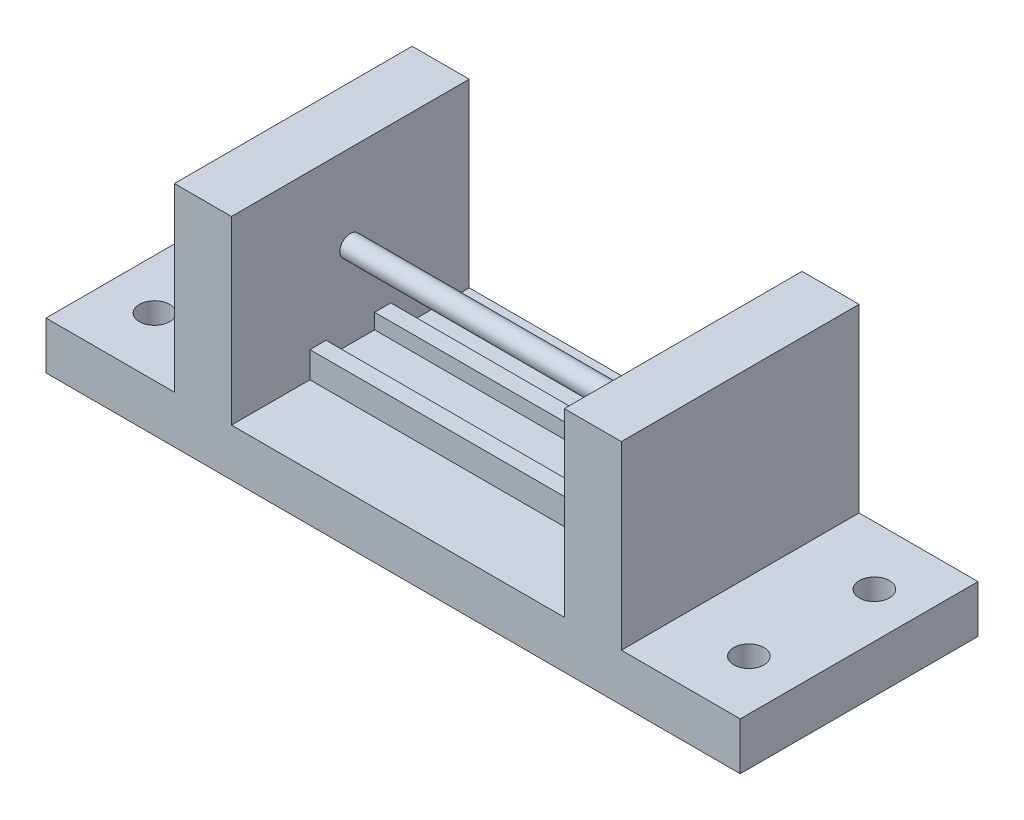
ISO-10303-21;
HEADER;
FILE_DESCRIPTION(('STEP AP214'),'2;1');
FILE_NAME('part.step','',(''),(''),'','','');
FILE_SCHEMA(('AUTOMOTIVE_DESIGN { 1 0 10303 214 1 1 1 1 }'));
ENDSEC;
DATA;
#1=APPLICATION_CONTEXT('core data for automotive mechanical design processes');
#2=APPLICATION_PROTOCOL_DEFINITION('international standard','automotive_design',2000,#1);
#3=PRODUCT_CONTEXT('',#1,'mechanical');
#4=PRODUCT('Part','Part','',(#3));
#5=PRODUCT_RELATED_PRODUCT_CATEGORY('part','',(#4));
#6=PRODUCT_DEFINITION_FORMATION('','',#4);
#7=PRODUCT_DEFINITION_CONTEXT('part definition',#1,'design');
#8=PRODUCT_DEFINITION('design','',#6,#7);
#9=PRODUCT_DEFINITION_SHAPE('','',#8);
#10=(LENGTH_UNIT() NAMED_UNIT(*) SI_UNIT(.MILLI.,.METRE.));
#11=(NAMED_UNIT(*) PLANE_ANGLE_UNIT() SI_UNIT($,.RADIAN.));
#12=(NAMED_UNIT(*) SI_UNIT($,.STERADIAN.) SOLID_ANGLE_UNIT());
#13=UNCERTAINTY_MEASURE_WITH_UNIT(LENGTH_MEASURE(1.E-05),#10,'distance_accuracy_value','');
#14=(GEOMETRIC_REPRESENTATION_CONTEXT(3) GLOBAL_UNCERTAINTY_ASSIGNED_CONTEXT((#13)) GLOBAL_UNIT_ASSIGNED_CONTEXT((#10,
#11,#12)) REPRESENTATION_CONTEXT('',''));
#15=CARTESIAN_POINT('',(0.,0.,0.));
#16=DIRECTION('',(0.,0.,1.));
#17=DIRECTION('',(1.,0.,0.));
#18=AXIS2_PLACEMENT_3D('',#15,#16,#17);
#19=CARTESIAN_POINT('',(32.7774603255584,30.2,25.));
#20=DIRECTION('',(1.,0.,0.));
#21=DIRECTION('',(0.,0.,-1.));
#22=AXIS2_PLACEMENT_3D('',#19,#20,#21);
#23=CYLINDRICAL_SURFACE('',#22,2.2);
#24=CARTESIAN_POINT('',(109.,30.2,25.));
#25=DIRECTION('',(1.,0.,0.));
#26=DIRECTION('',(0.,0.,-1.));
#27=AXIS2_PLACEMENT_3D('',#24,#25,#26);
#28=CIRCLE('',#27,2.2);
#29=CARTESIAN_POINT('',(109.,30.2,22.8));
#30=VERTEX_POINT('',#29);
#31=EDGE_CURVE('E20',#30,#30,#28,.F.);
#32=ORIENTED_EDGE('',*,*,#31,.T.);
#33=EDGE_LOOP('',(#32));
#34=FACE_BOUND('',#33,.T.);
#35=CARTESIAN_POINT('',(39.,30.2,25.));
#36=DIRECTION('',(1.,0.,0.));
#37=DIRECTION('',(0.,0.,-1.));
#38=AXIS2_PLACEMENT_3D('',#35,#36,#37);
#39=CIRCLE('',#38,2.2);
#40=CARTESIAN_POINT('',(39.,30.2,22.8));
#41=VERTEX_POINT('',#40);
#42=EDGE_CURVE('E229',#41,#41,#39,.T.);
#43=ORIENTED_EDGE('',*,*,#42,.T.);
#44=EDGE_LOOP('',(#43));
#45=FACE_BOUND('',#44,.T.);
#46=ADVANCED_FACE('F17',(#34,#45),#23,.T.);
#47=CARTESIAN_POINT('',(0.,15.5,0.));
#48=DIRECTION('',(0.,-1.,0.));
#49=DIRECTION('',(0.,0.,-1.));
#50=AXIS2_PLACEMENT_3D('',#47,#48,#49);
#51=PLANE('',#50);
#52=DIRECTION('',(-1.,0.,0.));
#53=VECTOR('',#52,1.);
#54=CARTESIAN_POINT('',(39.,15.5,19.9));
#55=LINE('',#54,#53);
#56=CARTESIAN_POINT('',(39.,15.5,19.9));
#57=VERTEX_POINT('',#56);
#58=CARTESIAN_POINT('',(109.,15.5,19.9));
#59=VERTEX_POINT('',#58);
#60=EDGE_CURVE('E200',#57,#59,#55,.F.);
#61=ORIENTED_EDGE('',*,*,#60,.T.);
#62=DIRECTION('',(0.,0.,-1.));
#63=VECTOR('',#62,1.);
#64=CARTESIAN_POINT('',(109.,15.5,0.));
#65=LINE('',#64,#63);
#66=CARTESIAN_POINT('',(109.,15.5,16.5));
#67=VERTEX_POINT('',#66);
#68=EDGE_CURVE('E250',#59,#67,#65,.T.);
#69=ORIENTED_EDGE('',*,*,#68,.T.);
#70=DIRECTION('',(1.,0.,0.));
#71=VECTOR('',#70,1.);
#72=CARTESIAN_POINT('',(39.,15.5,16.5));
#73=LINE('',#72,#71);
#74=CARTESIAN_POINT('',(39.,15.5,16.5));
#75=VERTEX_POINT('',#74);
#76=EDGE_CURVE('E167',#67,#75,#73,.F.);
#77=ORIENTED_EDGE('',*,*,#76,.T.);
#78=DIRECTION('',(0.,0.,1.));
#79=VECTOR('',#78,1.);
#80=CARTESIAN_POINT('',(39.,15.5,0.));
#81=LINE('',#80,#79);
#82=EDGE_CURVE('E231',#75,#57,#81,.T.);
#83=ORIENTED_EDGE('',*,*,#82,.T.);
#84=EDGE_LOOP('',(#61,#69,#77,#83));
#85=FACE_BOUND('',#84,.T.);
#86=ADVANCED_FACE('F286',(#85),#51,.F.);
#87=CARTESIAN_POINT('',(39.,12.3,19.9));
#88=DIRECTION('',(0.,0.,-1.));
#89=DIRECTION('',(-1.,0.,0.));
#90=AXIS2_PLACEMENT_3D('',#87,#88,#89);
#91=PLANE('',#90);
#92=DIRECTION('',(0.,1.,0.));
#93=VECTOR('',#92,1.);
#94=CARTESIAN_POINT('',(39.,48.,19.9));
#95=LINE('',#94,#93);
#96=CARTESIAN_POINT('',(39.,12.3,19.9));
#97=VERTEX_POINT('',#96);
#98=EDGE_CURVE('E236',#57,#97,#95,.F.);
#99=ORIENTED_EDGE('',*,*,#98,.T.);
#100=DIRECTION('',(1.,0.,0.));
#101=VECTOR('',#100,1.);
#102=CARTESIAN_POINT('',(0.,12.3,19.9));
#103=LINE('',#102,#101);
#104=CARTESIAN_POINT('',(109.,12.3,19.9));
#105=VERTEX_POINT('',#104);
#106=EDGE_CURVE('E198',#97,#105,#103,.T.);
#107=ORIENTED_EDGE('',*,*,#106,.T.);
#108=DIRECTION('',(0.,1.,0.));
#109=VECTOR('',#108,1.);
#110=CARTESIAN_POINT('',(109.,48.,19.9));
#111=LINE('',#110,#109);
#112=EDGE_CURVE('E253',#105,#59,#111,.T.);
#113=ORIENTED_EDGE('',*,*,#112,.T.);
#114=ORIENTED_EDGE('',*,*,#60,.F.);
#115=EDGE_LOOP('',(#99,#107,#113,#114));
#116=FACE_BOUND('',#115,.T.);
#117=ADVANCED_FACE('F282',(#116),#91,.F.);
#118=CARTESIAN_POINT('',(0.,12.3,0.));
#119=DIRECTION('',(0.,-1.,0.));
#120=DIRECTION('',(0.,0.,-1.));
#121=AXIS2_PLACEMENT_3D('',#118,#119,#120);
#122=PLANE('',#121);
#123=DIRECTION('',(0.,0.,1.));
#124=VECTOR('',#123,1.);
#125=CARTESIAN_POINT('',(39.,12.3,0.));
#126=LINE('',#125,#124);
#127=CARTESIAN_POINT('',(39.,12.3,30.1));
#128=VERTEX_POINT('',#127);
#129=EDGE_CURVE('E275',#97,#128,#126,.T.);
#130=ORIENTED_EDGE('',*,*,#129,.T.);
#131=DIRECTION('',(1.,0.,0.));
#132=VECTOR('',#131,1.);
#133=CARTESIAN_POINT('',(109.,12.3,30.0999999999999));
#134=LINE('',#133,#132);
#135=CARTESIAN_POINT('',(109.,12.3,30.0999999999999));
#136=VERTEX_POINT('',#135);
#137=EDGE_CURVE('E196',#128,#136,#134,.T.);
#138=ORIENTED_EDGE('',*,*,#137,.T.);
#139=DIRECTION('',(0.,0.,-1.));
#140=VECTOR('',#139,1.);
#141=CARTESIAN_POINT('',(109.,12.3,0.));
#142=LINE('',#141,#140);
#143=EDGE_CURVE('E256',#136,#105,#142,.T.);
#144=ORIENTED_EDGE('',*,*,#143,.T.);
#145=ORIENTED_EDGE('',*,*,#106,.F.);
#146=EDGE_LOOP('',(#130,#138,#144,#145));
#147=FACE_BOUND('',#146,.T.);
#148=ADVANCED_FACE('F472',(#147),#122,.F.);
#149=CARTESIAN_POINT('',(109.,12.3,30.0999999999999));
#150=DIRECTION('',(0.,0.,1.));
#151=DIRECTION('',(1.,0.,0.));
#152=AXIS2_PLACEMENT_3D('',#149,#150,#151);
#153=PLANE('',#152);
#154=DIRECTION('',(0.,1.,0.));
#155=VECTOR('',#154,1.);
#156=CARTESIAN_POINT('',(109.,48.,30.0999999999999));
#157=LINE('',#156,#155);
#158=CARTESIAN_POINT('',(109.,15.5,30.1));
#159=VERTEX_POINT('',#158);
#160=EDGE_CURVE('E259',#159,#136,#157,.F.);
#161=ORIENTED_EDGE('',*,*,#160,.T.);
#162=ORIENTED_EDGE('',*,*,#137,.F.);
#163=DIRECTION('',(0.,1.,0.));
#164=VECTOR('',#163,1.);
#165=CARTESIAN_POINT('',(39.,48.,30.1));
#166=LINE('',#165,#164);
#167=CARTESIAN_POINT('',(39.,15.5,30.1));
#168=VERTEX_POINT('',#167);
#169=EDGE_CURVE('E271',#128,#168,#166,.T.);
#170=ORIENTED_EDGE('',*,*,#169,.T.);
#171=DIRECTION('',(1.,0.,0.));
#172=VECTOR('',#171,1.);
#173=CARTESIAN_POINT('',(0.,15.5,30.1));
#174=LINE('',#173,#172);
#175=EDGE_CURVE('E194',#168,#159,#174,.T.);
#176=ORIENTED_EDGE('',*,*,#175,.T.);
#177=EDGE_LOOP('',(#161,#162,#170,#176));
#178=FACE_BOUND('',#177,.T.);
#179=ADVANCED_FACE('F274',(#178),#153,.F.);
#180=CARTESIAN_POINT('',(0.,15.5,0.));
#181=DIRECTION('',(0.,-1.,0.));
#182=DIRECTION('',(0.,0.,-1.));
#183=AXIS2_PLACEMENT_3D('',#180,#181,#182);
#184=PLANE('',#183);
#185=ORIENTED_EDGE('',*,*,#175,.F.);
#186=DIRECTION('',(0.,0.,1.));
#187=VECTOR('',#186,1.);
#188=CARTESIAN_POINT('',(39.,15.5,0.));
#189=LINE('',#188,#187);
#190=CARTESIAN_POINT('',(39.,15.5,33.5));
#191=VERTEX_POINT('',#190);
#192=EDGE_CURVE('E263',#168,#191,#189,.T.);
#193=ORIENTED_EDGE('',*,*,#192,.T.);
#194=DIRECTION('',(-1.,0.,0.));
#195=VECTOR('',#194,1.);
#196=CARTESIAN_POINT('',(109.,15.5,33.5));
#197=LINE('',#196,#195);
#198=CARTESIAN_POINT('',(109.,15.5,33.5));
#199=VERTEX_POINT('',#198);
#200=EDGE_CURVE('E151',#191,#199,#197,.F.);
#201=ORIENTED_EDGE('',*,*,#200,.T.);
#202=DIRECTION('',(0.,0.,-1.));
#203=VECTOR('',#202,1.);
#204=CARTESIAN_POINT('',(109.,15.5,0.));
#205=LINE('',#204,#203);
#206=EDGE_CURVE('E177',#199,#159,#205,.T.);
#207=ORIENTED_EDGE('',*,*,#206,.T.);
#208=EDGE_LOOP('',(#185,#193,#201,#207));
#209=FACE_BOUND('',#208,.T.);
#210=ADVANCED_FACE('F261',(#209),#184,.F.);
#211=CARTESIAN_POINT('',(109.,15.5,33.5));
#212=DIRECTION('',(0.,0.,-1.));
#213=DIRECTION('',(-1.,0.,0.));
#214=AXIS2_PLACEMENT_3D('',#211,#212,#213);
#215=PLANE('',#214);
#216=DIRECTION('',(0.,1.,0.));
#217=VECTOR('',#216,1.);
#218=CARTESIAN_POINT('',(109.,48.,33.5));
#219=LINE('',#218,#217);
#220=CARTESIAN_POINT('',(109.,10.,33.5));
#221=VERTEX_POINT('',#220);
#222=EDGE_CURVE('E160',#221,#199,#219,.T.);
#223=ORIENTED_EDGE('',*,*,#222,.T.);
#224=ORIENTED_EDGE('',*,*,#200,.F.);
#225=DIRECTION('',(0.,1.,0.));
#226=VECTOR('',#225,1.);
#227=CARTESIAN_POINT('',(39.,48.,33.5));
#228=LINE('',#227,#226);
#229=CARTESIAN_POINT('',(39.,10.,33.5));
#230=VERTEX_POINT('',#229);
#231=EDGE_CURVE('E162',#191,#230,#228,.F.);
#232=ORIENTED_EDGE('',*,*,#231,.T.);
#233=DIRECTION('',(1.,0.,0.));
#234=VECTOR('',#233,1.);
#235=CARTESIAN_POINT('',(0.,10.,33.5));
#236=LINE('',#235,#234);
#237=EDGE_CURVE('E157',#221,#230,#236,.F.);
#238=ORIENTED_EDGE('',*,*,#237,.F.);
#239=EDGE_LOOP('',(#223,#224,#232,#238));
#240=FACE_BOUND('',#239,.T.);
#241=ADVANCED_FACE('F159',(#240),#215,.F.);
#242=CARTESIAN_POINT('',(39.,15.5,16.5));
#243=DIRECTION('',(0.,0.,1.));
#244=DIRECTION('',(1.,0.,0.));
#245=AXIS2_PLACEMENT_3D('',#242,#243,#244);
#246=PLANE('',#245);
#247=DIRECTION('',(0.,1.,0.));
#248=VECTOR('',#247,1.);
#249=CARTESIAN_POINT('',(39.,48.,16.5));
#250=LINE('',#249,#248);
#251=CARTESIAN_POINT('',(39.,10.,16.5));
#252=VERTEX_POINT('',#251);
#253=EDGE_CURVE('E290',#252,#75,#250,.T.);
#254=ORIENTED_EDGE('',*,*,#253,.T.);
#255=ORIENTED_EDGE('',*,*,#76,.F.);
#256=DIRECTION('',(0.,1.,0.));
#257=VECTOR('',#256,1.);
#258=CARTESIAN_POINT('',(109.,48.,16.5));
#259=LINE('',#258,#257);
#260=CARTESIAN_POINT('',(109.,10.,16.5));
#261=VERTEX_POINT('',#260);
#262=EDGE_CURVE('E244',#67,#261,#259,.F.);
#263=ORIENTED_EDGE('',*,*,#262,.T.);
#264=DIRECTION('',(1.,0.,0.));
#265=VECTOR('',#264,1.);
#266=CARTESIAN_POINT('',(0.,10.,16.5));
#267=LINE('',#266,#265);
#268=EDGE_CURVE('E238',#252,#261,#267,.T.);
#269=ORIENTED_EDGE('',*,*,#268,.F.);
#270=EDGE_LOOP('',(#254,#255,#263,#269));
#271=FACE_BOUND('',#270,.T.);
#272=ADVANCED_FACE('F291',(#271),#246,.F.);
#273=CARTESIAN_POINT('',(0.,10.,0.));
#274=DIRECTION('',(0.,1.,0.));
#275=DIRECTION('',(0.,0.,1.));
#276=AXIS2_PLACEMENT_3D('',#273,#274,#275);
#277=PLANE('',#276);
#278=DIRECTION('',(0.,0.,1.));
#279=VECTOR('',#278,1.);
#280=CARTESIAN_POINT('',(39.,10.,0.));
#281=LINE('',#280,#279);
#282=CARTESIAN_POINT('',(39.,10.,50.));
#283=VERTEX_POINT('',#282);
#284=EDGE_CURVE('E298',#230,#283,#281,.T.);
#285=ORIENTED_EDGE('',*,*,#284,.T.);
#286=DIRECTION('',(-1.,0.,0.));
#287=VECTOR('',#286,1.);
#288=CARTESIAN_POINT('',(0.,10.,50.));
#289=LINE('',#288,#287);
#290=CARTESIAN_POINT('',(109.,10.,50.));
#291=VERTEX_POINT('',#290);
#292=EDGE_CURVE('E182',#283,#291,#289,.F.);
#293=ORIENTED_EDGE('',*,*,#292,.T.);
#294=DIRECTION('',(0.,0.,-1.));
#295=VECTOR('',#294,1.);
#296=CARTESIAN_POINT('',(109.,10.,0.));
#297=LINE('',#296,#295);
#298=EDGE_CURVE('E174',#291,#221,#297,.T.);
#299=ORIENTED_EDGE('',*,*,#298,.T.);
#300=ORIENTED_EDGE('',*,*,#237,.T.);
#301=EDGE_LOOP('',(#285,#293,#299,#300));
#302=FACE_BOUND('',#301,.T.);
#303=ADVANCED_FACE('F180',(#302),#277,.T.);
#304=CARTESIAN_POINT('',(0.,10.,0.));
#305=DIRECTION('',(0.,1.,0.));
#306=DIRECTION('',(0.,0.,1.));
#307=AXIS2_PLACEMENT_3D('',#304,#305,#306);
#308=PLANE('',#307);
#309=CARTESIAN_POINT('',(136.5,10.,12.3));
#310=DIRECTION('',(0.,1.,0.));
#311=DIRECTION('',(0.,0.,1.));
#312=AXIS2_PLACEMENT_3D('',#309,#310,#311);
#313=CIRCLE('',#312,3.175);
#314=CARTESIAN_POINT('',(136.5,10.,15.475));
#315=VERTEX_POINT('',#314);
#316=EDGE_CURVE('E226',#315,#315,#313,.F.);
#317=ORIENTED_EDGE('',*,*,#316,.T.);
#318=EDGE_LOOP('',(#317));
#319=FACE_BOUND('',#318,.T.);
#320=CARTESIAN_POINT('',(135.5,10.,37.6803073267445));
#321=DIRECTION('',(0.,1.,0.));
#322=DIRECTION('',(0.,0.,1.));
#323=AXIS2_PLACEMENT_3D('',#320,#321,#322);
#324=CIRCLE('',#323,3.175);
#325=CARTESIAN_POINT('',(135.5,10.,40.8553073267445));
#326=VERTEX_POINT('',#325);
#327=EDGE_CURVE('E223',#326,#326,#324,.F.);
#328=ORIENTED_EDGE('',*,*,#327,.T.);
#329=EDGE_LOOP('',(#328));
#330=FACE_BOUND('',#329,.T.);
#331=DIRECTION('',(0.,0.,1.));
#332=VECTOR('',#331,1.);
#333=CARTESIAN_POINT('',(146.,10.,0.));
#334=LINE('',#333,#332);
#335=CARTESIAN_POINT('',(146.,10.,50.));
#336=VERTEX_POINT('',#335);
#337=CARTESIAN_POINT('',(146.,10.,0.));
#338=VERTEX_POINT('',#337);
#339=EDGE_CURVE('E370',#336,#338,#334,.F.);
#340=ORIENTED_EDGE('',*,*,#339,.T.);
#341=DIRECTION('',(1.,0.,0.));
#342=VECTOR('',#341,1.);
#343=CARTESIAN_POINT('',(0.,10.,0.));
#344=LINE('',#343,#342);
#345=CARTESIAN_POINT('',(121.,10.,0.));
#346=VERTEX_POINT('',#345);
#347=EDGE_CURVE('E364',#338,#346,#344,.F.);
#348=ORIENTED_EDGE('',*,*,#347,.T.);
#349=DIRECTION('',(0.,0.,1.));
#350=VECTOR('',#349,1.);
#351=CARTESIAN_POINT('',(121.,10.,0.));
#352=LINE('',#351,#350);
#353=CARTESIAN_POINT('',(121.,10.,50.));
#354=VERTEX_POINT('',#353);
#355=EDGE_CURVE('E166',#346,#354,#352,.T.);
#356=ORIENTED_EDGE('',*,*,#355,.T.);
#357=DIRECTION('',(-1.,0.,0.));
#358=VECTOR('',#357,1.);
#359=CARTESIAN_POINT('',(0.,10.,50.));
#360=LINE('',#359,#358);
#361=EDGE_CURVE('E374',#354,#336,#360,.F.);
#362=ORIENTED_EDGE('',*,*,#361,.T.);
#363=EDGE_LOOP('',(#340,#348,#356,#362));
#364=FACE_BOUND('',#363,.T.);
#365=ADVANCED_FACE('F394',(#319,#330,#364),#308,.T.);
#366=CARTESIAN_POINT('',(121.,48.,0.));
#367=DIRECTION('',(-1.,0.,0.));
#368=DIRECTION('',(0.,0.,1.));
#369=AXIS2_PLACEMENT_3D('',#366,#367,#368);
#370=PLANE('',#369);
#371=DIRECTION('',(0.,1.,0.));
#372=VECTOR('',#371,1.);
#373=CARTESIAN_POINT('',(121.,10.,0.));
#374=LINE('',#373,#372);
#375=CARTESIAN_POINT('',(121.,48.,0.));
#376=VERTEX_POINT('',#375);
#377=EDGE_CURVE('E361',#346,#376,#374,.T.);
#378=ORIENTED_EDGE('',*,*,#377,.T.);
#379=DIRECTION('',(0.,0.,-1.));
#380=VECTOR('',#379,1.);
#381=CARTESIAN_POINT('',(121.,48.,0.));
#382=LINE('',#381,#380);
#383=CARTESIAN_POINT('',(121.,48.,50.));
#384=VERTEX_POINT('',#383);
#385=EDGE_CURVE('E188',#376,#384,#382,.F.);
#386=ORIENTED_EDGE('',*,*,#385,.T.);
#387=DIRECTION('',(0.,1.,0.));
#388=VECTOR('',#387,1.);
#389=CARTESIAN_POINT('',(121.,10.,50.));
#390=LINE('',#389,#388);
#391=EDGE_CURVE('E376',#384,#354,#390,.F.);
#392=ORIENTED_EDGE('',*,*,#391,.T.);
#393=ORIENTED_EDGE('',*,*,#355,.F.);
#394=EDGE_LOOP('',(#378,#386,#392,#393));
#395=FACE_BOUND('',#394,.T.);
#396=ADVANCED_FACE('F389',(#395),#370,.F.);
#397=CARTESIAN_POINT('',(0.,48.,0.));
#398=DIRECTION('',(0.,-1.,0.));
#399=DIRECTION('',(0.,0.,-1.));
#400=AXIS2_PLACEMENT_3D('',#397,#398,#399);
#401=PLANE('',#400);
#402=DIRECTION('',(1.,0.,0.));
#403=VECTOR('',#402,1.);
#404=CARTESIAN_POINT('',(0.,48.,0.));
#405=LINE('',#404,#403);
#406=CARTESIAN_POINT('',(109.,48.,0.));
#407=VERTEX_POINT('',#406);
#408=EDGE_CURVE('E358',#376,#407,#405,.F.);
#409=ORIENTED_EDGE('',*,*,#408,.T.);
#410=DIRECTION('',(0.,0.,-1.));
#411=VECTOR('',#410,1.);
#412=CARTESIAN_POINT('',(109.,48.,0.));
#413=LINE('',#412,#411);
#414=CARTESIAN_POINT('',(109.,48.,50.));
#415=VERTEX_POINT('',#414);
#416=EDGE_CURVE('E183',#407,#415,#413,.F.);
#417=ORIENTED_EDGE('',*,*,#416,.T.);
#418=DIRECTION('',(-1.,0.,0.));
#419=VECTOR('',#418,1.);
#420=CARTESIAN_POINT('',(0.,48.,50.));
#421=LINE('',#420,#419);
#422=EDGE_CURVE('E379',#415,#384,#421,.F.);
#423=ORIENTED_EDGE('',*,*,#422,.T.);
#424=ORIENTED_EDGE('',*,*,#385,.F.);
#425=EDGE_LOOP('',(#409,#417,#423,#424));
#426=FACE_BOUND('',#425,.T.);
#427=ADVANCED_FACE('F386',(#426),#401,.F.);
#428=CARTESIAN_POINT('',(109.,48.,0.));
#429=DIRECTION('',(1.,0.,0.));
#430=DIRECTION('',(0.,0.,-1.));
#431=AXIS2_PLACEMENT_3D('',#428,#429,#430);
#432=PLANE('',#431);
#433=ORIENTED_EDGE('',*,*,#68,.F.);
#434=ORIENTED_EDGE('',*,*,#112,.F.);
#435=ORIENTED_EDGE('',*,*,#143,.F.);
#436=ORIENTED_EDGE('',*,*,#160,.F.);
#437=ORIENTED_EDGE('',*,*,#206,.F.);
#438=ORIENTED_EDGE('',*,*,#222,.F.);
#439=ORIENTED_EDGE('',*,*,#298,.F.);
#440=DIRECTION('',(0.,1.,0.));
#441=VECTOR('',#440,1.);
#442=CARTESIAN_POINT('',(109.,10.,50.));
#443=LINE('',#442,#441);
#444=EDGE_CURVE('E311',#291,#415,#443,.T.);
#445=ORIENTED_EDGE('',*,*,#444,.T.);
#446=ORIENTED_EDGE('',*,*,#416,.F.);
#447=DIRECTION('',(0.,1.,0.));
#448=VECTOR('',#447,1.);
#449=CARTESIAN_POINT('',(109.,10.,0.));
#450=LINE('',#449,#448);
#451=CARTESIAN_POINT('',(109.,10.,0.));
#452=VERTEX_POINT('',#451);
#453=EDGE_CURVE('E355',#407,#452,#450,.F.);
#454=ORIENTED_EDGE('',*,*,#453,.T.);
#455=DIRECTION('',(0.,0.,1.));
#456=VECTOR('',#455,1.);
#457=CARTESIAN_POINT('',(109.,10.,0.));
#458=LINE('',#457,#456);
#459=EDGE_CURVE('E232',#261,#452,#458,.F.);
#460=ORIENTED_EDGE('',*,*,#459,.F.);
#461=ORIENTED_EDGE('',*,*,#262,.F.);
#462=EDGE_LOOP('',(#433,#434,#435,#436,#437,#438,#439,#445,#446,#454,#460,#461));
#463=FACE_BOUND('',#462,.T.);
#464=ORIENTED_EDGE('',*,*,#31,.F.);
#465=EDGE_LOOP('',(#464));
#466=FACE_BOUND('',#465,.T.);
#467=ADVANCED_FACE('F171',(#463,#466),#432,.F.);
#468=CARTESIAN_POINT('',(0.,10.,0.));
#469=DIRECTION('',(0.,1.,0.));
#470=DIRECTION('',(0.,0.,1.));
#471=AXIS2_PLACEMENT_3D('',#468,#469,#470);
#472=PLANE('',#471);
#473=ORIENTED_EDGE('',*,*,#459,.T.);
#474=DIRECTION('',(1.,0.,0.));
#475=VECTOR('',#474,1.);
#476=CARTESIAN_POINT('',(0.,10.,0.));
#477=LINE('',#476,#475);
#478=CARTESIAN_POINT('',(39.,10.,0.));
#479=VERTEX_POINT('',#478);
#480=EDGE_CURVE('E353',#452,#479,#477,.F.);
#481=ORIENTED_EDGE('',*,*,#480,.T.);
#482=DIRECTION('',(0.,0.,1.));
#483=VECTOR('',#482,1.);
#484=CARTESIAN_POINT('',(39.,10.,0.));
#485=LINE('',#484,#483);
#486=EDGE_CURVE('E294',#479,#252,#485,.T.);
#487=ORIENTED_EDGE('',*,*,#486,.T.);
#488=ORIENTED_EDGE('',*,*,#268,.T.);
#489=EDGE_LOOP('',(#473,#481,#487,#488));
#490=FACE_BOUND('',#489,.T.);
#491=ADVANCED_FACE('F450',(#490),#472,.T.);
#492=CARTESIAN_POINT('',(39.,48.,0.));
#493=DIRECTION('',(-1.,0.,0.));
#494=DIRECTION('',(0.,0.,1.));
#495=AXIS2_PLACEMENT_3D('',#492,#493,#494);
#496=PLANE('',#495);
#497=ORIENTED_EDGE('',*,*,#486,.F.);
#498=DIRECTION('',(0.,1.,0.));
#499=VECTOR('',#498,1.);
#500=CARTESIAN_POINT('',(39.,10.,0.));
#501=LINE('',#500,#499);
#502=CARTESIAN_POINT('',(39.,48.,0.));
#503=VERTEX_POINT('',#502);
#504=EDGE_CURVE('E351',#479,#503,#501,.T.);
#505=ORIENTED_EDGE('',*,*,#504,.T.);
#506=DIRECTION('',(0.,0.,1.));
#507=VECTOR('',#506,1.);
#508=CARTESIAN_POINT('',(39.,48.,0.));
#509=LINE('',#508,#507);
#510=CARTESIAN_POINT('',(39.,48.,50.));
#511=VERTEX_POINT('',#510);
#512=EDGE_CURVE('E293',#511,#503,#509,.F.);
#513=ORIENTED_EDGE('',*,*,#512,.F.);
#514=DIRECTION('',(0.,1.,0.));
#515=VECTOR('',#514,1.);
#516=CARTESIAN_POINT('',(39.,10.,50.));
#517=LINE('',#516,#515);
#518=EDGE_CURVE('E308',#511,#283,#517,.F.);
#519=ORIENTED_EDGE('',*,*,#518,.T.);
#520=ORIENTED_EDGE('',*,*,#284,.F.);
#521=ORIENTED_EDGE('',*,*,#231,.F.);
#522=ORIENTED_EDGE('',*,*,#192,.F.);
#523=ORIENTED_EDGE('',*,*,#169,.F.);
#524=ORIENTED_EDGE('',*,*,#129,.F.);
#525=ORIENTED_EDGE('',*,*,#98,.F.);
#526=ORIENTED_EDGE('',*,*,#82,.F.);
#527=ORIENTED_EDGE('',*,*,#253,.F.);
#528=EDGE_LOOP('',(#497,#505,#513,#519,#520,#521,#522,#523,#524,#525,#526,#527));
#529=FACE_BOUND('',#528,.T.);
#530=ORIENTED_EDGE('',*,*,#42,.F.);
#531=EDGE_LOOP('',(#530));
#532=FACE_BOUND('',#531,.T.);
#533=ADVANCED_FACE('F268',(#529,#532),#496,.F.);
#534=CARTESIAN_POINT('',(0.,48.,0.));
#535=DIRECTION('',(0.,1.,0.));
#536=DIRECTION('',(0.,0.,1.));
#537=AXIS2_PLACEMENT_3D('',#534,#535,#536);
#538=PLANE('',#537);
#539=ORIENTED_EDGE('',*,*,#512,.T.);
#540=DIRECTION('',(1.,0.,0.));
#541=VECTOR('',#540,1.);
#542=CARTESIAN_POINT('',(0.,48.,0.));
#543=LINE('',#542,#541);
#544=CARTESIAN_POINT('',(27.,48.,0.));
#545=VERTEX_POINT('',#544);
#546=EDGE_CURVE('E328',#503,#545,#543,.F.);
#547=ORIENTED_EDGE('',*,*,#546,.T.);
#548=DIRECTION('',(0.,0.,-1.));
#549=VECTOR('',#548,1.);
#550=CARTESIAN_POINT('',(27.,48.,0.));
#551=LINE('',#550,#549);
#552=CARTESIAN_POINT('',(27.,48.,50.));
#553=VERTEX_POINT('',#552);
#554=EDGE_CURVE('E296',#545,#553,#551,.F.);
#555=ORIENTED_EDGE('',*,*,#554,.T.);
#556=DIRECTION('',(-1.,0.,0.));
#557=VECTOR('',#556,1.);
#558=CARTESIAN_POINT('',(0.,48.,50.));
#559=LINE('',#558,#557);
#560=EDGE_CURVE('E314',#553,#511,#559,.F.);
#561=ORIENTED_EDGE('',*,*,#560,.T.);
#562=EDGE_LOOP('',(#539,#547,#555,#561));
#563=FACE_BOUND('',#562,.T.);
#564=ADVANCED_FACE('F326',(#563),#538,.T.);
#565=CARTESIAN_POINT('',(27.,48.,0.));
#566=DIRECTION('',(1.,0.,0.));
#567=DIRECTION('',(0.,0.,-1.));
#568=AXIS2_PLACEMENT_3D('',#565,#566,#567);
#569=PLANE('',#568);
#570=DIRECTION('',(0.,1.,0.));
#571=VECTOR('',#570,1.);
#572=CARTESIAN_POINT('',(27.,10.,50.));
#573=LINE('',#572,#571);
#574=CARTESIAN_POINT('',(27.,10.,50.));
#575=VERTEX_POINT('',#574);
#576=EDGE_CURVE('E316',#575,#553,#573,.T.);
#577=ORIENTED_EDGE('',*,*,#576,.T.);
#578=ORIENTED_EDGE('',*,*,#554,.F.);
#579=DIRECTION('',(0.,1.,0.));
#580=VECTOR('',#579,1.);
#581=CARTESIAN_POINT('',(27.,10.,0.));
#582=LINE('',#581,#580);
#583=CARTESIAN_POINT('',(27.,10.,0.));
#584=VERTEX_POINT('',#583);
#585=EDGE_CURVE('E334',#545,#584,#582,.F.);
#586=ORIENTED_EDGE('',*,*,#585,.T.);
#587=DIRECTION('',(0.,0.,1.));
#588=VECTOR('',#587,1.);
#589=CARTESIAN_POINT('',(27.,10.,0.));
#590=LINE('',#589,#588);
#591=EDGE_CURVE('E228',#575,#584,#590,.F.);
#592=ORIENTED_EDGE('',*,*,#591,.F.);
#593=EDGE_LOOP('',(#577,#578,#586,#592));
#594=FACE_BOUND('',#593,.T.);
#595=ADVANCED_FACE('F333',(#594),#569,.F.);
#596=CARTESIAN_POINT('',(0.,10.,0.));
#597=DIRECTION('',(0.,1.,0.));
#598=DIRECTION('',(0.,0.,1.));
#599=AXIS2_PLACEMENT_3D('',#596,#597,#598);
#600=PLANE('',#599);
#601=DIRECTION('',(1.,0.,0.));
#602=VECTOR('',#601,1.);
#603=CARTESIAN_POINT('',(0.,10.,0.));
#604=LINE('',#603,#602);
#605=CARTESIAN_POINT('',(0.,10.,0.));
#606=VERTEX_POINT('',#605);
#607=EDGE_CURVE('E340',#584,#606,#604,.F.);
#608=ORIENTED_EDGE('',*,*,#607,.T.);
#609=DIRECTION('',(0.,0.,-1.));
#610=VECTOR('',#609,1.);
#611=CARTESIAN_POINT('',(0.,10.,0.));
#612=LINE('',#611,#610);
#613=CARTESIAN_POINT('',(0.,10.,50.));
#614=VERTEX_POINT('',#613);
#615=EDGE_CURVE('E345',#606,#614,#612,.F.);
#616=ORIENTED_EDGE('',*,*,#615,.T.);
#617=DIRECTION('',(-1.,0.,0.));
#618=VECTOR('',#617,1.);
#619=CARTESIAN_POINT('',(0.,10.,50.));
#620=LINE('',#619,#618);
#621=EDGE_CURVE('E219',#614,#575,#620,.F.);
#622=ORIENTED_EDGE('',*,*,#621,.T.);
#623=ORIENTED_EDGE('',*,*,#591,.T.);
#624=EDGE_LOOP('',(#608,#616,#622,#623));
#625=FACE_BOUND('',#624,.T.);
#626=CARTESIAN_POINT('',(10.5,10.,37.6803073267445));
#627=DIRECTION('',(0.,1.,0.));
#628=DIRECTION('',(0.,0.,1.));
#629=AXIS2_PLACEMENT_3D('',#626,#627,#628);
#630=CIRCLE('',#629,3.175);
#631=CARTESIAN_POINT('',(10.5,10.,40.8553073267445));
#632=VERTEX_POINT('',#631);
#633=EDGE_CURVE('E216',#632,#632,#630,.F.);
#634=ORIENTED_EDGE('',*,*,#633,.T.);
#635=EDGE_LOOP('',(#634));
#636=FACE_BOUND('',#635,.T.);
#637=CARTESIAN_POINT('',(9.5,10.,12.3));
#638=DIRECTION('',(0.,1.,0.));
#639=DIRECTION('',(0.,0.,1.));
#640=AXIS2_PLACEMENT_3D('',#637,#638,#639);
#641=CIRCLE('',#640,3.175);
#642=CARTESIAN_POINT('',(9.5,10.,15.475));
#643=VERTEX_POINT('',#642);
#644=EDGE_CURVE('E220',#643,#643,#641,.F.);
#645=ORIENTED_EDGE('',*,*,#644,.T.);
#646=EDGE_LOOP('',(#645));
#647=FACE_BOUND('',#646,.T.);
#648=ADVANCED_FACE('F337',(#625,#636,#647),#600,.T.);
#649=CARTESIAN_POINT('',(136.5,0.,12.3));
#650=DIRECTION('',(0.,1.,0.));
#651=DIRECTION('',(0.,0.,1.));
#652=AXIS2_PLACEMENT_3D('',#649,#650,#651);
#653=CYLINDRICAL_SURFACE('',#652,3.175);
#654=ORIENTED_EDGE('',*,*,#316,.F.);
#655=EDGE_LOOP('',(#654));
#656=FACE_BOUND('',#655,.T.);
#657=CARTESIAN_POINT('',(136.5,0.,12.3));
#658=DIRECTION('',(0.,1.,0.));
#659=DIRECTION('',(0.,0.,1.));
#660=AXIS2_PLACEMENT_3D('',#657,#658,#659);
#661=CIRCLE('',#660,3.175);
#662=CARTESIAN_POINT('',(136.5,0.,15.475));
#663=VERTEX_POINT('',#662);
#664=EDGE_CURVE('E212',#663,#663,#661,.F.);
#665=ORIENTED_EDGE('',*,*,#664,.T.);
#666=EDGE_LOOP('',(#665));
#667=FACE_BOUND('',#666,.T.);
#668=ADVANCED_FACE('F437',(#656,#667),#653,.F.);
#669=CARTESIAN_POINT('',(135.5,0.,37.6803073267445));
#670=DIRECTION('',(0.,1.,0.));
#671=DIRECTION('',(0.,0.,1.));
#672=AXIS2_PLACEMENT_3D('',#669,#670,#671);
#673=CYLINDRICAL_SURFACE('',#672,3.175);
#674=ORIENTED_EDGE('',*,*,#327,.F.);
#675=EDGE_LOOP('',(#674));
#676=FACE_BOUND('',#675,.T.);
#677=CARTESIAN_POINT('',(135.5,0.,37.6803073267445));
#678=DIRECTION('',(0.,1.,0.));
#679=DIRECTION('',(0.,0.,1.));
#680=AXIS2_PLACEMENT_3D('',#677,#678,#679);
#681=CIRCLE('',#680,3.175);
#682=CARTESIAN_POINT('',(135.5,0.,40.8553073267445));
#683=VERTEX_POINT('',#682);
#684=EDGE_CURVE('E209',#683,#683,#681,.F.);
#685=ORIENTED_EDGE('',*,*,#684,.T.);
#686=EDGE_LOOP('',(#685));
#687=FACE_BOUND('',#686,.T.);
#688=ADVANCED_FACE('F433',(#676,#687),#673,.F.);
#689=CARTESIAN_POINT('',(9.5,0.,12.3));
#690=DIRECTION('',(0.,1.,0.));
#691=DIRECTION('',(0.,0.,1.));
#692=AXIS2_PLACEMENT_3D('',#689,#690,#691);
#693=CYLINDRICAL_SURFACE('',#692,3.175);
#694=CARTESIAN_POINT('',(9.5,0.,12.3));
#695=DIRECTION('',(0.,1.,0.));
#696=DIRECTION('',(0.,0.,1.));
#697=AXIS2_PLACEMENT_3D('',#694,#695,#696);
#698=CIRCLE('',#697,3.175);
#699=CARTESIAN_POINT('',(9.5,0.,15.475));
#700=VERTEX_POINT('',#699);
#701=EDGE_CURVE('E206',#700,#700,#698,.F.);
#702=ORIENTED_EDGE('',*,*,#701,.T.);
#703=EDGE_LOOP('',(#702));
#704=FACE_BOUND('',#703,.T.);
#705=ORIENTED_EDGE('',*,*,#644,.F.);
#706=EDGE_LOOP('',(#705));
#707=FACE_BOUND('',#706,.T.);
#708=ADVANCED_FACE('F429',(#704,#707),#693,.F.);
#709=CARTESIAN_POINT('',(10.5,0.,37.6803073267445));
#710=DIRECTION('',(0.,1.,0.));
#711=DIRECTION('',(0.,0.,1.));
#712=AXIS2_PLACEMENT_3D('',#709,#710,#711);
#713=CYLINDRICAL_SURFACE('',#712,3.175);
#714=CARTESIAN_POINT('',(10.5,0.,37.6803073267445));
#715=DIRECTION('',(0.,1.,0.));
#716=DIRECTION('',(0.,0.,1.));
#717=AXIS2_PLACEMENT_3D('',#714,#715,#716);
#718=CIRCLE('',#717,3.175);
#719=CARTESIAN_POINT('',(10.5,0.,40.8553073267445));
#720=VERTEX_POINT('',#719);
#721=EDGE_CURVE('E202',#720,#720,#718,.F.);
#722=ORIENTED_EDGE('',*,*,#721,.T.);
#723=EDGE_LOOP('',(#722));
#724=FACE_BOUND('',#723,.T.);
#725=ORIENTED_EDGE('',*,*,#633,.F.);
#726=EDGE_LOOP('',(#725));
#727=FACE_BOUND('',#726,.T.);
#728=ADVANCED_FACE('F426',(#724,#727),#713,.F.);
#729=CARTESIAN_POINT('',(0.,10.,50.));
#730=DIRECTION('',(0.,0.,-1.));
#731=DIRECTION('',(-1.,0.,0.));
#732=AXIS2_PLACEMENT_3D('',#729,#730,#731);
#733=PLANE('',#732);
#734=DIRECTION('',(0.,1.,0.));
#735=VECTOR('',#734,1.);
#736=CARTESIAN_POINT('',(146.,10.,50.));
#737=LINE('',#736,#735);
#738=CARTESIAN_POINT('',(146.,0.,50.));
#739=VERTEX_POINT('',#738);
#740=EDGE_CURVE('E372',#739,#336,#737,.T.);
#741=ORIENTED_EDGE('',*,*,#740,.T.);
#742=ORIENTED_EDGE('',*,*,#361,.F.);
#743=ORIENTED_EDGE('',*,*,#391,.F.);
#744=ORIENTED_EDGE('',*,*,#422,.F.);
#745=ORIENTED_EDGE('',*,*,#444,.F.);
#746=ORIENTED_EDGE('',*,*,#292,.F.);
#747=ORIENTED_EDGE('',*,*,#518,.F.);
#748=ORIENTED_EDGE('',*,*,#560,.F.);
#749=ORIENTED_EDGE('',*,*,#576,.F.);
#750=ORIENTED_EDGE('',*,*,#621,.F.);
#751=DIRECTION('',(0.,1.,0.));
#752=VECTOR('',#751,1.);
#753=CARTESIAN_POINT('',(0.,10.,50.));
#754=LINE('',#753,#752);
#755=CARTESIAN_POINT('',(0.,0.,50.));
#756=VERTEX_POINT('',#755);
#757=EDGE_CURVE('E215',#614,#756,#754,.F.);
#758=ORIENTED_EDGE('',*,*,#757,.T.);
#759=DIRECTION('',(1.,0.,0.));
#760=VECTOR('',#759,1.);
#761=CARTESIAN_POINT('',(0.,0.,50.));
#762=LINE('',#761,#760);
#763=EDGE_CURVE('E205',#756,#739,#762,.T.);
#764=ORIENTED_EDGE('',*,*,#763,.T.);
#765=EDGE_LOOP('',(#741,#742,#743,#744,#745,#746,#747,#748,#749,#750,#758,#764));
#766=FACE_BOUND('',#765,.T.);
#767=ADVANCED_FACE('F306',(#766),#733,.F.);
#768=CARTESIAN_POINT('',(146.,10.,0.));
#769=DIRECTION('',(-1.,0.,0.));
#770=DIRECTION('',(0.,0.,1.));
#771=AXIS2_PLACEMENT_3D('',#768,#769,#770);
#772=PLANE('',#771);
#773=DIRECTION('',(0.,1.,0.));
#774=VECTOR('',#773,1.);
#775=CARTESIAN_POINT('',(146.,10.,0.));
#776=LINE('',#775,#774);
#777=CARTESIAN_POINT('',(146.,0.,0.));
#778=VERTEX_POINT('',#777);
#779=EDGE_CURVE('E367',#778,#338,#776,.T.);
#780=ORIENTED_EDGE('',*,*,#779,.T.);
#781=ORIENTED_EDGE('',*,*,#339,.F.);
#782=ORIENTED_EDGE('',*,*,#740,.F.);
#783=DIRECTION('',(0.,0.,1.));
#784=VECTOR('',#783,1.);
#785=CARTESIAN_POINT('',(146.,0.,0.));
#786=LINE('',#785,#784);
#787=EDGE_CURVE('E400',#739,#778,#786,.F.);
#788=ORIENTED_EDGE('',*,*,#787,.T.);
#789=EDGE_LOOP('',(#780,#781,#782,#788));
#790=FACE_BOUND('',#789,.T.);
#791=ADVANCED_FACE('F397',(#790),#772,.F.);
#792=CARTESIAN_POINT('',(0.,10.,0.));
#793=DIRECTION('',(0.,0.,1.));
#794=DIRECTION('',(1.,0.,0.));
#795=AXIS2_PLACEMENT_3D('',#792,#793,#794);
#796=PLANE('',#795);
#797=DIRECTION('',(0.,1.,0.));
#798=VECTOR('',#797,1.);
#799=CARTESIAN_POINT('',(0.,10.,0.));
#800=LINE('',#799,#798);
#801=CARTESIAN_POINT('',(0.,0.,0.));
#802=VERTEX_POINT('',#801);
#803=EDGE_CURVE('E34',#802,#606,#800,.T.);
#804=ORIENTED_EDGE('',*,*,#803,.T.);
#805=ORIENTED_EDGE('',*,*,#607,.F.);
#806=ORIENTED_EDGE('',*,*,#585,.F.);
#807=ORIENTED_EDGE('',*,*,#546,.F.);
#808=ORIENTED_EDGE('',*,*,#504,.F.);
#809=ORIENTED_EDGE('',*,*,#480,.F.);
#810=ORIENTED_EDGE('',*,*,#453,.F.);
#811=ORIENTED_EDGE('',*,*,#408,.F.);
#812=ORIENTED_EDGE('',*,*,#377,.F.);
#813=ORIENTED_EDGE('',*,*,#347,.F.);
#814=ORIENTED_EDGE('',*,*,#779,.F.);
#815=DIRECTION('',(1.,0.,0.));
#816=VECTOR('',#815,1.);
#817=CARTESIAN_POINT('',(0.,0.,0.));
#818=LINE('',#817,#816);
#819=EDGE_CURVE('E26',#778,#802,#818,.F.);
#820=ORIENTED_EDGE('',*,*,#819,.T.);
#821=EDGE_LOOP('',(#804,#805,#806,#807,#808,#809,#810,#811,#812,#813,#814,#820));
#822=FACE_BOUND('',#821,.T.);
#823=ADVANCED_FACE('F342',(#822),#796,.F.);
#824=CARTESIAN_POINT('',(0.,10.,0.));
#825=DIRECTION('',(1.,0.,0.));
#826=DIRECTION('',(0.,0.,-1.));
#827=AXIS2_PLACEMENT_3D('',#824,#825,#826);
#828=PLANE('',#827);
#829=ORIENTED_EDGE('',*,*,#757,.F.);
#830=ORIENTED_EDGE('',*,*,#615,.F.);
#831=ORIENTED_EDGE('',*,*,#803,.F.);
#832=DIRECTION('',(0.,0.,1.));
#833=VECTOR('',#832,1.);
#834=CARTESIAN_POINT('',(0.,0.,0.));
#835=LINE('',#834,#833);
#836=EDGE_CURVE('E11',#802,#756,#835,.T.);
#837=ORIENTED_EDGE('',*,*,#836,.T.);
#838=EDGE_LOOP('',(#829,#830,#831,#837));
#839=FACE_BOUND('',#838,.T.);
#840=ADVANCED_FACE('F411',(#839),#828,.F.);
#841=CARTESIAN_POINT('',(0.,0.,0.));
#842=DIRECTION('',(0.,1.,0.));
#843=DIRECTION('',(0.,0.,1.));
#844=AXIS2_PLACEMENT_3D('',#841,#842,#843);
#845=PLANE('',#844);
#846=ORIENTED_EDGE('',*,*,#819,.F.);
#847=ORIENTED_EDGE('',*,*,#787,.F.);
#848=ORIENTED_EDGE('',*,*,#763,.F.);
#849=ORIENTED_EDGE('',*,*,#836,.F.);
#850=EDGE_LOOP('',(#846,#847,#848,#849));
#851=FACE_BOUND('',#850,.T.);
#852=ORIENTED_EDGE('',*,*,#721,.F.);
#853=EDGE_LOOP('',(#852));
#854=FACE_BOUND('',#853,.T.);
#855=ORIENTED_EDGE('',*,*,#701,.F.);
#856=EDGE_LOOP('',(#855));
#857=FACE_BOUND('',#856,.T.);
#858=ORIENTED_EDGE('',*,*,#684,.F.);
#859=EDGE_LOOP('',(#858));
#860=FACE_BOUND('',#859,.T.);
#861=ORIENTED_EDGE('',*,*,#664,.F.);
#862=EDGE_LOOP('',(#861));
#863=FACE_BOUND('',#862,.T.);
#864=ADVANCED_FACE('F403',(#851,#854,#857,#860,#863),#845,.F.);
#865=CLOSED_SHELL('',(#46,#86,#117,#148,#179,#210,#241,#272,#303,#365,#396,#427,#467,#491,#533,
#564,#595,#648,#668,#688,#708,#728,#767,#791,#823,#840,#864));
#866=MANIFOLD_SOLID_BREP('B1',#865);
#867=ADVANCED_BREP_SHAPE_REPRESENTATION('',(#18,#866),#14);
#868=SHAPE_DEFINITION_REPRESENTATION(#9,#867);
ENDSEC;
END-ISO-10303-21;
